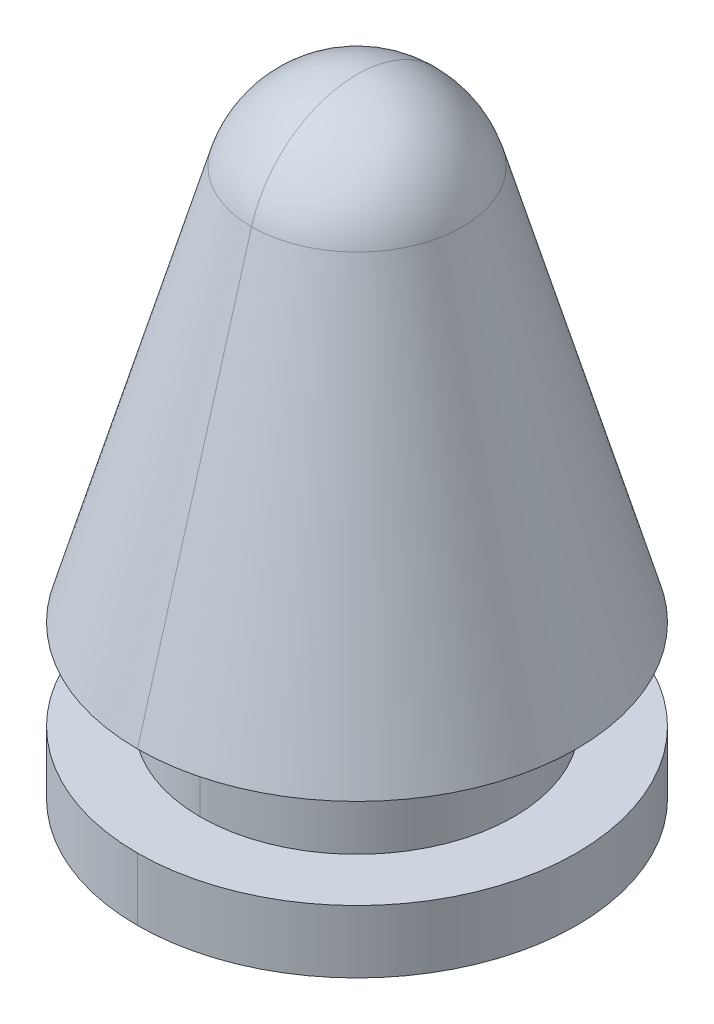
ISO-10303-21;
HEADER;
FILE_DESCRIPTION(('STEP AP214'),'2;1');
FILE_NAME('part.step','',(''),(''),'','','');
FILE_SCHEMA(('AUTOMOTIVE_DESIGN { 1 0 10303 214 1 1 1 1 }'));
ENDSEC;
DATA;
#1=APPLICATION_CONTEXT('core data for automotive mechanical design processes');
#2=APPLICATION_PROTOCOL_DEFINITION('international standard','automotive_design',2000,#1);
#3=PRODUCT_CONTEXT('',#1,'mechanical');
#4=PRODUCT('Part','Part','',(#3));
#5=PRODUCT_RELATED_PRODUCT_CATEGORY('part','',(#4));
#6=PRODUCT_DEFINITION_FORMATION('','',#4);
#7=PRODUCT_DEFINITION_CONTEXT('part definition',#1,'design');
#8=PRODUCT_DEFINITION('design','',#6,#7);
#9=PRODUCT_DEFINITION_SHAPE('','',#8);
#10=(LENGTH_UNIT() NAMED_UNIT(*) SI_UNIT(.MILLI.,.METRE.));
#11=(NAMED_UNIT(*) PLANE_ANGLE_UNIT() SI_UNIT($,.RADIAN.));
#12=(NAMED_UNIT(*) SI_UNIT($,.STERADIAN.) SOLID_ANGLE_UNIT());
#13=UNCERTAINTY_MEASURE_WITH_UNIT(LENGTH_MEASURE(1.E-05),#10,'distance_accuracy_value','');
#14=(GEOMETRIC_REPRESENTATION_CONTEXT(3) GLOBAL_UNCERTAINTY_ASSIGNED_CONTEXT((#13)) GLOBAL_UNIT_ASSIGNED_CONTEXT((#10,
#11,#12)) REPRESENTATION_CONTEXT('',''));
#15=CARTESIAN_POINT('',(0.,0.,0.));
#16=DIRECTION('',(0.,0.,1.));
#17=DIRECTION('',(1.,0.,0.));
#18=AXIS2_PLACEMENT_3D('',#15,#16,#17);
#19=CARTESIAN_POINT('',(0.,26.,0.));
#20=DIRECTION('',(-1.,0.,0.));
#21=DIRECTION('',(0.,0.,-1.));
#22=AXIS2_PLACEMENT_3D('',#19,#20,#21);
#23=SPHERICAL_SURFACE('',#22,14.);
#24=CARTESIAN_POINT('',(0.,26.,0.));
#25=DIRECTION('',(-1.,0.,0.));
#26=DIRECTION('',(0.,0.,1.));
#27=AXIS2_PLACEMENT_3D('',#24,#25,#26);
#28=CIRCLE('',#27,14.);
#29=CARTESIAN_POINT('',(0.,29.8841197441619,13.4504131465547));
#30=VERTEX_POINT('',#29);
#31=CARTESIAN_POINT('',(0.,40.,0.));
#32=VERTEX_POINT('',#31);
#33=EDGE_CURVE('E128',#30,#32,#28,.T.);
#34=ORIENTED_EDGE('',*,*,#33,.F.);
#35=CARTESIAN_POINT('',(0.,29.8841197441619,0.));
#36=DIRECTION('',(0.,1.,0.));
#37=DIRECTION('',(0.,0.,1.));
#38=AXIS2_PLACEMENT_3D('',#35,#36,#37);
#39=CIRCLE('',#38,13.4504131465547);
#40=CARTESIAN_POINT('',(0.,29.8841197441619,-13.4504131465547));
#41=VERTEX_POINT('',#40);
#42=EDGE_CURVE('E122',#30,#41,#39,.T.);
#43=ORIENTED_EDGE('',*,*,#42,.T.);
#44=CARTESIAN_POINT('',(0.,26.,0.));
#45=DIRECTION('',(1.,0.,0.));
#46=DIRECTION('',(0.,0.,-1.));
#47=AXIS2_PLACEMENT_3D('',#44,#45,#46);
#48=CIRCLE('',#47,14.);
#49=EDGE_CURVE('E133',#41,#32,#48,.T.);
#50=ORIENTED_EDGE('',*,*,#49,.T.);
#51=EDGE_LOOP('',(#34,#43,#50));
#52=FACE_BOUND('',#51,.T.);
#53=ADVANCED_FACE('F15',(#52),#23,.T.);
#54=CARTESIAN_POINT('',(0.,29.8841197441619,0.));
#55=DIRECTION('',(0.,-1.,0.));
#56=DIRECTION('',(0.,0.,-1.));
#57=AXIS2_PLACEMENT_3D('',#54,#55,#56);
#58=CONICAL_SURFACE('',#57,13.4504131465547,0.281125482709445);
#59=DIRECTION('',(0.,-0.960743796182478,0.277437124582997));
#60=VECTOR('',#59,1.);
#61=CARTESIAN_POINT('',(0.,29.8841197441619,13.4504131465547));
#62=LINE('',#61,#60);
#63=CARTESIAN_POINT('',(0.,-20.5,28.));
#64=VERTEX_POINT('',#63);
#65=EDGE_CURVE('E118',#30,#64,#62,.T.);
#66=ORIENTED_EDGE('',*,*,#65,.F.);
#67=CARTESIAN_POINT('',(0.,29.8841197441619,0.));
#68=DIRECTION('',(0.,1.,0.));
#69=DIRECTION('',(0.,0.,1.));
#70=AXIS2_PLACEMENT_3D('',#67,#68,#69);
#71=CIRCLE('',#70,13.4504131465547);
#72=EDGE_CURVE('E124',#41,#30,#71,.T.);
#73=ORIENTED_EDGE('',*,*,#72,.F.);
#74=DIRECTION('',(0.,-0.960743796182478,-0.277437124582997));
#75=VECTOR('',#74,1.);
#76=CARTESIAN_POINT('',(0.,29.8841197441619,-13.4504131465547));
#77=LINE('',#76,#75);
#78=CARTESIAN_POINT('',(0.,-20.5,-28.));
#79=VERTEX_POINT('',#78);
#80=EDGE_CURVE('E112',#41,#79,#77,.T.);
#81=ORIENTED_EDGE('',*,*,#80,.T.);
#82=CARTESIAN_POINT('',(0.,-20.5,0.));
#83=DIRECTION('',(0.,1.,0.));
#84=DIRECTION('',(0.,0.,1.));
#85=AXIS2_PLACEMENT_3D('',#82,#83,#84);
#86=CIRCLE('',#85,28.);
#87=EDGE_CURVE('E10',#79,#64,#86,.T.);
#88=ORIENTED_EDGE('',*,*,#87,.T.);
#89=EDGE_LOOP('',(#66,#73,#81,#88));
#90=FACE_BOUND('',#89,.T.);
#91=ADVANCED_FACE('F204',(#90),#58,.T.);
#92=CARTESIAN_POINT('',(0.,-20.5,0.));
#93=DIRECTION('',(0.,-1.,0.));
#94=DIRECTION('',(0.,0.,-1.));
#95=AXIS2_PLACEMENT_3D('',#92,#93,#94);
#96=PLANE('',#95);
#97=CARTESIAN_POINT('',(0.,-20.5,0.));
#98=DIRECTION('',(0.,1.,0.));
#99=DIRECTION('',(0.,0.,1.));
#100=AXIS2_PLACEMENT_3D('',#97,#98,#99);
#101=CIRCLE('',#100,20.);
#102=CARTESIAN_POINT('',(0.,-20.5,20.));
#103=VERTEX_POINT('',#102);
#104=CARTESIAN_POINT('',(0.,-20.5,-20.));
#105=VERTEX_POINT('',#104);
#106=EDGE_CURVE('E108',#103,#105,#101,.T.);
#107=ORIENTED_EDGE('',*,*,#106,.T.);
#108=CARTESIAN_POINT('',(0.,-20.5,0.));
#109=DIRECTION('',(0.,1.,0.));
#110=DIRECTION('',(0.,0.,1.));
#111=AXIS2_PLACEMENT_3D('',#108,#109,#110);
#112=CIRCLE('',#111,20.);
#113=EDGE_CURVE('E26',#105,#103,#112,.T.);
#114=ORIENTED_EDGE('',*,*,#113,.T.);
#115=EDGE_LOOP('',(#107,#114));
#116=FACE_BOUND('',#115,.T.);
#117=ORIENTED_EDGE('',*,*,#87,.F.);
#118=CARTESIAN_POINT('',(0.,-20.5,0.));
#119=DIRECTION('',(0.,1.,0.));
#120=DIRECTION('',(0.,0.,1.));
#121=AXIS2_PLACEMENT_3D('',#118,#119,#120);
#122=CIRCLE('',#121,28.);
#123=EDGE_CURVE('E121',#64,#79,#122,.T.);
#124=ORIENTED_EDGE('',*,*,#123,.F.);
#125=EDGE_LOOP('',(#117,#124));
#126=FACE_BOUND('',#125,.T.);
#127=ADVANCED_FACE('F199',(#116,#126),#96,.T.);
#128=CARTESIAN_POINT('',(0.,40.,0.));
#129=DIRECTION('',(0.,1.,0.));
#130=DIRECTION('',(0.,0.,1.));
#131=AXIS2_PLACEMENT_3D('',#128,#129,#130);
#132=CYLINDRICAL_SURFACE('',#131,20.);
#133=DIRECTION('',(0.,1.,0.));
#134=VECTOR('',#133,1.);
#135=CARTESIAN_POINT('',(0.,40.,-20.));
#136=LINE('',#135,#134);
#137=CARTESIAN_POINT('',(0.,-32.,-20.));
#138=VERTEX_POINT('',#137);
#139=EDGE_CURVE('E153',#138,#105,#136,.T.);
#140=ORIENTED_EDGE('',*,*,#139,.F.);
#141=CARTESIAN_POINT('',(0.,-32.,0.));
#142=DIRECTION('',(0.,1.,0.));
#143=DIRECTION('',(0.,0.,1.));
#144=AXIS2_PLACEMENT_3D('',#141,#142,#143);
#145=CIRCLE('',#144,20.);
#146=CARTESIAN_POINT('',(0.,-32.,20.));
#147=VERTEX_POINT('',#146);
#148=EDGE_CURVE('E115',#138,#147,#145,.T.);
#149=ORIENTED_EDGE('',*,*,#148,.T.);
#150=DIRECTION('',(0.,1.,0.));
#151=VECTOR('',#150,1.);
#152=CARTESIAN_POINT('',(0.,40.,20.));
#153=LINE('',#152,#151);
#154=EDGE_CURVE('E98',#147,#103,#153,.T.);
#155=ORIENTED_EDGE('',*,*,#154,.T.);
#156=ORIENTED_EDGE('',*,*,#113,.F.);
#157=EDGE_LOOP('',(#140,#149,#155,#156));
#158=FACE_BOUND('',#157,.T.);
#159=ADVANCED_FACE('F184',(#158),#132,.T.);
#160=CARTESIAN_POINT('',(0.,-32.,0.));
#161=DIRECTION('',(0.,1.,0.));
#162=DIRECTION('',(1.,0.,0.));
#163=AXIS2_PLACEMENT_3D('',#160,#161,#162);
#164=PLANE('',#163);
#165=CARTESIAN_POINT('',(0.,-32.,0.));
#166=DIRECTION('',(0.,1.,0.));
#167=DIRECTION('',(0.,0.,1.));
#168=AXIS2_PLACEMENT_3D('',#165,#166,#167);
#169=CIRCLE('',#168,20.);
#170=EDGE_CURVE('E19',#147,#138,#169,.T.);
#171=ORIENTED_EDGE('',*,*,#170,.F.);
#172=ORIENTED_EDGE('',*,*,#148,.F.);
#173=EDGE_LOOP('',(#171,#172));
#174=FACE_BOUND('',#173,.T.);
#175=CARTESIAN_POINT('',(0.,-32.,0.));
#176=DIRECTION('',(0.,1.,0.));
#177=DIRECTION('',(0.,0.,1.));
#178=AXIS2_PLACEMENT_3D('',#175,#176,#177);
#179=CIRCLE('',#178,28.);
#180=CARTESIAN_POINT('',(0.,-32.,28.));
#181=VERTEX_POINT('',#180);
#182=CARTESIAN_POINT('',(0.,-32.,-28.));
#183=VERTEX_POINT('',#182);
#184=EDGE_CURVE('E93',#181,#183,#179,.T.);
#185=ORIENTED_EDGE('',*,*,#184,.T.);
#186=CARTESIAN_POINT('',(0.,-32.,0.));
#187=DIRECTION('',(0.,1.,0.));
#188=DIRECTION('',(0.,0.,1.));
#189=AXIS2_PLACEMENT_3D('',#186,#187,#188);
#190=CIRCLE('',#189,28.);
#191=EDGE_CURVE('E40',#183,#181,#190,.T.);
#192=ORIENTED_EDGE('',*,*,#191,.T.);
#193=EDGE_LOOP('',(#185,#192));
#194=FACE_BOUND('',#193,.T.);
#195=ADVANCED_FACE('F190',(#174,#194),#164,.T.);
#196=CARTESIAN_POINT('',(0.,-40.,0.));
#197=DIRECTION('',(0.,-1.,0.));
#198=DIRECTION('',(0.,0.,-1.));
#199=AXIS2_PLACEMENT_3D('',#196,#197,#198);
#200=PLANE('',#199);
#201=CARTESIAN_POINT('',(0.,-40.,0.));
#202=DIRECTION('',(0.,1.,0.));
#203=DIRECTION('',(0.,0.,1.));
#204=AXIS2_PLACEMENT_3D('',#201,#202,#203);
#205=CIRCLE('',#204,28.);
#206=CARTESIAN_POINT('',(0.,-40.,28.));
#207=VERTEX_POINT('',#206);
#208=CARTESIAN_POINT('',(0.,-40.,-28.));
#209=VERTEX_POINT('',#208);
#210=EDGE_CURVE('E92',#207,#209,#205,.T.);
#211=ORIENTED_EDGE('',*,*,#210,.F.);
#212=CARTESIAN_POINT('',(0.,-40.,0.));
#213=DIRECTION('',(0.,1.,0.));
#214=DIRECTION('',(0.,0.,1.));
#215=AXIS2_PLACEMENT_3D('',#212,#213,#214);
#216=CIRCLE('',#215,28.);
#217=EDGE_CURVE('E79',#209,#207,#216,.T.);
#218=ORIENTED_EDGE('',*,*,#217,.F.);
#219=EDGE_LOOP('',(#211,#218));
#220=FACE_BOUND('',#219,.T.);
#221=ADVANCED_FACE('F96',(#220),#200,.T.);
#222=CARTESIAN_POINT('',(0.,40.,0.));
#223=DIRECTION('',(0.,1.,0.));
#224=DIRECTION('',(0.,0.,1.));
#225=AXIS2_PLACEMENT_3D('',#222,#223,#224);
#226=CYLINDRICAL_SURFACE('',#225,28.);
#227=DIRECTION('',(0.,1.,0.));
#228=VECTOR('',#227,1.);
#229=CARTESIAN_POINT('',(0.,40.,-28.));
#230=LINE('',#229,#228);
#231=EDGE_CURVE('E85',#209,#183,#230,.T.);
#232=ORIENTED_EDGE('',*,*,#231,.F.);
#233=ORIENTED_EDGE('',*,*,#217,.T.);
#234=DIRECTION('',(0.,1.,0.));
#235=VECTOR('',#234,1.);
#236=CARTESIAN_POINT('',(0.,40.,28.));
#237=LINE('',#236,#235);
#238=EDGE_CURVE('E82',#207,#181,#237,.T.);
#239=ORIENTED_EDGE('',*,*,#238,.T.);
#240=ORIENTED_EDGE('',*,*,#191,.F.);
#241=EDGE_LOOP('',(#232,#233,#239,#240));
#242=FACE_BOUND('',#241,.T.);
#243=ADVANCED_FACE('F81',(#242),#226,.T.);
#244=CARTESIAN_POINT('',(0.,40.,0.));
#245=DIRECTION('',(0.,1.,0.));
#246=DIRECTION('',(0.,0.,1.));
#247=AXIS2_PLACEMENT_3D('',#244,#245,#246);
#248=CYLINDRICAL_SURFACE('',#247,28.);
#249=ORIENTED_EDGE('',*,*,#210,.T.);
#250=ORIENTED_EDGE('',*,*,#231,.T.);
#251=ORIENTED_EDGE('',*,*,#184,.F.);
#252=ORIENTED_EDGE('',*,*,#238,.F.);
#253=EDGE_LOOP('',(#249,#250,#251,#252));
#254=FACE_BOUND('',#253,.T.);
#255=ADVANCED_FACE('F17',(#254),#248,.T.);
#256=CARTESIAN_POINT('',(0.,40.,0.));
#257=DIRECTION('',(0.,1.,0.));
#258=DIRECTION('',(0.,0.,1.));
#259=AXIS2_PLACEMENT_3D('',#256,#257,#258);
#260=CYLINDRICAL_SURFACE('',#259,20.);
#261=ORIENTED_EDGE('',*,*,#170,.T.);
#262=ORIENTED_EDGE('',*,*,#139,.T.);
#263=ORIENTED_EDGE('',*,*,#106,.F.);
#264=ORIENTED_EDGE('',*,*,#154,.F.);
#265=EDGE_LOOP('',(#261,#262,#263,#264));
#266=FACE_BOUND('',#265,.T.);
#267=ADVANCED_FACE('F179',(#266),#260,.T.);
#268=CARTESIAN_POINT('',(0.,29.8841197441619,0.));
#269=DIRECTION('',(0.,-1.,0.));
#270=DIRECTION('',(0.,0.,-1.));
#271=AXIS2_PLACEMENT_3D('',#268,#269,#270);
#272=CONICAL_SURFACE('',#271,13.4504131465547,0.281125482709445);
#273=ORIENTED_EDGE('',*,*,#42,.F.);
#274=ORIENTED_EDGE('',*,*,#65,.T.);
#275=ORIENTED_EDGE('',*,*,#123,.T.);
#276=ORIENTED_EDGE('',*,*,#80,.F.);
#277=EDGE_LOOP('',(#273,#274,#275,#276));
#278=FACE_BOUND('',#277,.T.);
#279=ADVANCED_FACE('F215',(#278),#272,.T.);
#280=CARTESIAN_POINT('',(0.,26.,0.));
#281=DIRECTION('',(-1.,0.,0.));
#282=DIRECTION('',(0.,0.,-1.));
#283=AXIS2_PLACEMENT_3D('',#280,#281,#282);
#284=SPHERICAL_SURFACE('',#283,14.);
#285=ORIENTED_EDGE('',*,*,#72,.T.);
#286=ORIENTED_EDGE('',*,*,#33,.T.);
#287=ORIENTED_EDGE('',*,*,#49,.F.);
#288=EDGE_LOOP('',(#285,#286,#287));
#289=FACE_BOUND('',#288,.T.);
#290=ADVANCED_FACE('F217',(#289),#284,.T.);
#291=CLOSED_SHELL('',(#53,#91,#127,#159,#195,#221,#243,#255,#267,#279,#290));
#292=MANIFOLD_SOLID_BREP('B1',#291);
#293=ADVANCED_BREP_SHAPE_REPRESENTATION('',(#18,#292),#14);
#294=SHAPE_DEFINITION_REPRESENTATION(#9,#293);
ENDSEC;
END-ISO-10303-21;
